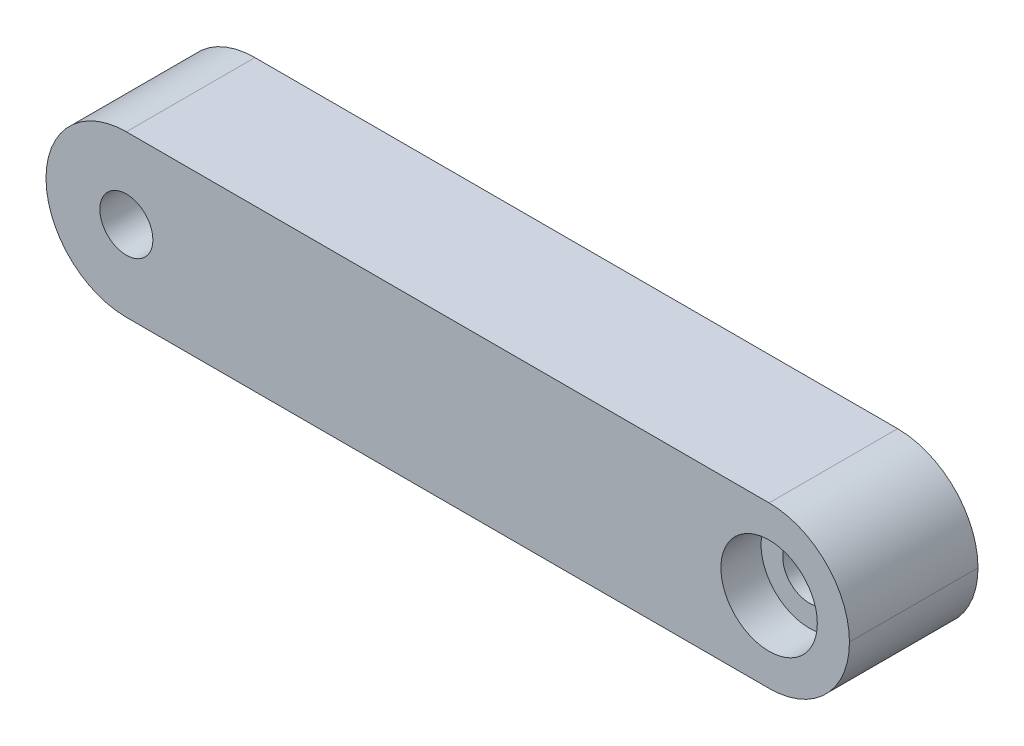
ISO-10303-21;
HEADER;
FILE_DESCRIPTION(('STEP AP214'),'2;1');
FILE_NAME('part.step','',(''),(''),'','','');
FILE_SCHEMA(('AUTOMOTIVE_DESIGN { 1 0 10303 214 1 1 1 1 }'));
ENDSEC;
DATA;
#1=APPLICATION_CONTEXT('core data for automotive mechanical design processes');
#2=APPLICATION_PROTOCOL_DEFINITION('international standard','automotive_design',2000,#1);
#3=PRODUCT_CONTEXT('',#1,'mechanical');
#4=PRODUCT('Part','Part','',(#3));
#5=PRODUCT_RELATED_PRODUCT_CATEGORY('part','',(#4));
#6=PRODUCT_DEFINITION_FORMATION('','',#4);
#7=PRODUCT_DEFINITION_CONTEXT('part definition',#1,'design');
#8=PRODUCT_DEFINITION('design','',#6,#7);
#9=PRODUCT_DEFINITION_SHAPE('','',#8);
#10=(LENGTH_UNIT() NAMED_UNIT(*) SI_UNIT(.MILLI.,.METRE.));
#11=(NAMED_UNIT(*) PLANE_ANGLE_UNIT() SI_UNIT($,.RADIAN.));
#12=(NAMED_UNIT(*) SI_UNIT($,.STERADIAN.) SOLID_ANGLE_UNIT());
#13=UNCERTAINTY_MEASURE_WITH_UNIT(LENGTH_MEASURE(1.E-05),#10,'distance_accuracy_value','');
#14=(GEOMETRIC_REPRESENTATION_CONTEXT(3) GLOBAL_UNCERTAINTY_ASSIGNED_CONTEXT((#13)) GLOBAL_UNIT_ASSIGNED_CONTEXT((#10,
#11,#12)) REPRESENTATION_CONTEXT('',''));
#15=CARTESIAN_POINT('',(0.,0.,0.));
#16=DIRECTION('',(0.,0.,1.));
#17=DIRECTION('',(1.,0.,0.));
#18=AXIS2_PLACEMENT_3D('',#15,#16,#17);
#19=CARTESIAN_POINT('',(5.,5.,0.));
#20=DIRECTION('',(0.,0.,1.));
#21=DIRECTION('',(1.,0.,0.));
#22=AXIS2_PLACEMENT_3D('',#19,#20,#21);
#23=CYLINDRICAL_SURFACE('',#22,1.65);
#24=CARTESIAN_POINT('',(5.,5.,8.));
#25=DIRECTION('',(0.,0.,1.));
#26=DIRECTION('',(1.,0.,0.));
#27=AXIS2_PLACEMENT_3D('',#24,#25,#26);
#28=CIRCLE('',#27,1.65);
#29=CARTESIAN_POINT('',(6.65,5.,8.));
#30=VERTEX_POINT('',#29);
#31=EDGE_CURVE('E191',#30,#30,#28,.T.);
#32=ORIENTED_EDGE('',*,*,#31,.T.);
#33=EDGE_LOOP('',(#32));
#34=FACE_BOUND('',#33,.T.);
#35=CARTESIAN_POINT('',(5.,5.,2.5));
#36=DIRECTION('',(0.,0.,-1.));
#37=DIRECTION('',(-1.,0.,0.));
#38=AXIS2_PLACEMENT_3D('',#35,#36,#37);
#39=CIRCLE('',#38,1.65);
#40=CARTESIAN_POINT('',(3.35,5.,2.5));
#41=VERTEX_POINT('',#40);
#42=EDGE_CURVE('E39',#41,#41,#39,.F.);
#43=ORIENTED_EDGE('',*,*,#42,.F.);
#44=EDGE_LOOP('',(#43));
#45=FACE_BOUND('',#44,.T.);
#46=ADVANCED_FACE('F35',(#34,#45),#23,.F.);
#47=CARTESIAN_POINT('',(45.,5.,0.));
#48=DIRECTION('',(0.,0.,1.));
#49=DIRECTION('',(1.,0.,0.));
#50=AXIS2_PLACEMENT_3D('',#47,#48,#49);
#51=CYLINDRICAL_SURFACE('',#50,1.65);
#52=CARTESIAN_POINT('',(45.,5.,0.));
#53=DIRECTION('',(0.,0.,1.));
#54=DIRECTION('',(1.,0.,0.));
#55=AXIS2_PLACEMENT_3D('',#52,#53,#54);
#56=CIRCLE('',#55,1.65);
#57=CARTESIAN_POINT('',(46.65,5.,0.));
#58=VERTEX_POINT('',#57);
#59=EDGE_CURVE('E188',#58,#58,#56,.T.);
#60=ORIENTED_EDGE('',*,*,#59,.F.);
#61=EDGE_LOOP('',(#60));
#62=FACE_BOUND('',#61,.T.);
#63=CARTESIAN_POINT('',(45.,5.,5.5));
#64=DIRECTION('',(0.,0.,1.));
#65=DIRECTION('',(1.,0.,0.));
#66=AXIS2_PLACEMENT_3D('',#63,#64,#65);
#67=CIRCLE('',#66,1.65);
#68=CARTESIAN_POINT('',(46.65,5.,5.5));
#69=VERTEX_POINT('',#68);
#70=EDGE_CURVE('E184',#69,#69,#67,.F.);
#71=ORIENTED_EDGE('',*,*,#70,.F.);
#72=EDGE_LOOP('',(#71));
#73=FACE_BOUND('',#72,.T.);
#74=ADVANCED_FACE('F237',(#62,#73),#51,.F.);
#75=CARTESIAN_POINT('',(0.,0.,8.));
#76=DIRECTION('',(0.,1.,0.));
#77=DIRECTION('',(0.,0.,1.));
#78=AXIS2_PLACEMENT_3D('',#75,#76,#77);
#79=PLANE('',#78);
#80=DIRECTION('',(1.,0.,0.));
#81=VECTOR('',#80,1.);
#82=CARTESIAN_POINT('',(0.,0.,0.));
#83=LINE('',#82,#81);
#84=CARTESIAN_POINT('',(5.,0.,0.));
#85=VERTEX_POINT('',#84);
#86=CARTESIAN_POINT('',(45.,0.,0.));
#87=VERTEX_POINT('',#86);
#88=EDGE_CURVE('E195',#85,#87,#83,.T.);
#89=ORIENTED_EDGE('',*,*,#88,.T.);
#90=DIRECTION('',(0.,0.,-1.));
#91=VECTOR('',#90,1.);
#92=CARTESIAN_POINT('',(45.,0.,8.));
#93=LINE('',#92,#91);
#94=CARTESIAN_POINT('',(45.,0.,8.));
#95=VERTEX_POINT('',#94);
#96=EDGE_CURVE('E216',#87,#95,#93,.F.);
#97=ORIENTED_EDGE('',*,*,#96,.T.);
#98=DIRECTION('',(1.,0.,0.));
#99=VECTOR('',#98,1.);
#100=CARTESIAN_POINT('',(0.,0.,8.));
#101=LINE('',#100,#99);
#102=CARTESIAN_POINT('',(5.,0.,8.));
#103=VERTEX_POINT('',#102);
#104=EDGE_CURVE('E196',#103,#95,#101,.T.);
#105=ORIENTED_EDGE('',*,*,#104,.F.);
#106=DIRECTION('',(0.,0.,-1.));
#107=VECTOR('',#106,1.);
#108=CARTESIAN_POINT('',(5.,0.,8.));
#109=LINE('',#108,#107);
#110=EDGE_CURVE('E213',#103,#85,#109,.T.);
#111=ORIENTED_EDGE('',*,*,#110,.T.);
#112=EDGE_LOOP('',(#89,#97,#105,#111));
#113=FACE_BOUND('',#112,.T.);
#114=ADVANCED_FACE('F239',(#113),#79,.F.);
#115=CARTESIAN_POINT('',(0.,10.,8.));
#116=DIRECTION('',(0.,-1.,0.));
#117=DIRECTION('',(0.,0.,-1.));
#118=AXIS2_PLACEMENT_3D('',#115,#116,#117);
#119=PLANE('',#118);
#120=DIRECTION('',(-1.,0.,0.));
#121=VECTOR('',#120,1.);
#122=CARTESIAN_POINT('',(0.,10.,8.));
#123=LINE('',#122,#121);
#124=CARTESIAN_POINT('',(45.,10.,8.));
#125=VERTEX_POINT('',#124);
#126=CARTESIAN_POINT('',(5.,10.,8.));
#127=VERTEX_POINT('',#126);
#128=EDGE_CURVE('E199',#125,#127,#123,.T.);
#129=ORIENTED_EDGE('',*,*,#128,.F.);
#130=DIRECTION('',(0.,0.,-1.));
#131=VECTOR('',#130,1.);
#132=CARTESIAN_POINT('',(45.,10.,8.));
#133=LINE('',#132,#131);
#134=CARTESIAN_POINT('',(45.,10.,0.));
#135=VERTEX_POINT('',#134);
#136=EDGE_CURVE('E11',#125,#135,#133,.T.);
#137=ORIENTED_EDGE('',*,*,#136,.T.);
#138=DIRECTION('',(-1.,0.,0.));
#139=VECTOR('',#138,1.);
#140=CARTESIAN_POINT('',(0.,10.,0.));
#141=LINE('',#140,#139);
#142=CARTESIAN_POINT('',(5.,10.,0.));
#143=VERTEX_POINT('',#142);
#144=EDGE_CURVE('E200',#135,#143,#141,.T.);
#145=ORIENTED_EDGE('',*,*,#144,.T.);
#146=DIRECTION('',(0.,0.,-1.));
#147=VECTOR('',#146,1.);
#148=CARTESIAN_POINT('',(5.,10.,8.));
#149=LINE('',#148,#147);
#150=EDGE_CURVE('E44',#143,#127,#149,.F.);
#151=ORIENTED_EDGE('',*,*,#150,.T.);
#152=EDGE_LOOP('',(#129,#137,#145,#151));
#153=FACE_BOUND('',#152,.T.);
#154=ADVANCED_FACE('F246',(#153),#119,.F.);
#155=CARTESIAN_POINT('',(0.,0.,8.));
#156=DIRECTION('',(0.,0.,-1.));
#157=DIRECTION('',(-1.,0.,0.));
#158=AXIS2_PLACEMENT_3D('',#155,#156,#157);
#159=PLANE('',#158);
#160=CARTESIAN_POINT('',(45.,5.,8.));
#161=DIRECTION('',(0.,0.,1.));
#162=DIRECTION('',(1.,0.,0.));
#163=AXIS2_PLACEMENT_3D('',#160,#161,#162);
#164=CIRCLE('',#163,3.);
#165=CARTESIAN_POINT('',(48.,5.,8.));
#166=VERTEX_POINT('',#165);
#167=EDGE_CURVE('E185',#166,#166,#164,.T.);
#168=ORIENTED_EDGE('',*,*,#167,.F.);
#169=EDGE_LOOP('',(#168));
#170=FACE_BOUND('',#169,.T.);
#171=ORIENTED_EDGE('',*,*,#31,.F.);
#172=EDGE_LOOP('',(#171));
#173=FACE_BOUND('',#172,.T.);
#174=ORIENTED_EDGE('',*,*,#104,.T.);
#175=CARTESIAN_POINT('',(45.,5.,8.));
#176=DIRECTION('',(0.,0.,-1.));
#177=DIRECTION('',(-1.,0.,0.));
#178=AXIS2_PLACEMENT_3D('',#175,#176,#177);
#179=CIRCLE('',#178,5.);
#180=CARTESIAN_POINT('',(50.,5.,8.));
#181=VERTEX_POINT('',#180);
#182=EDGE_CURVE('E225',#95,#181,#179,.F.);
#183=ORIENTED_EDGE('',*,*,#182,.T.);
#184=CARTESIAN_POINT('',(45.,5.,8.));
#185=DIRECTION('',(0.,0.,-1.));
#186=DIRECTION('',(-1.,0.,0.));
#187=AXIS2_PLACEMENT_3D('',#184,#185,#186);
#188=CIRCLE('',#187,5.);
#189=EDGE_CURVE('E223',#181,#125,#188,.F.);
#190=ORIENTED_EDGE('',*,*,#189,.T.);
#191=ORIENTED_EDGE('',*,*,#128,.T.);
#192=CARTESIAN_POINT('',(5.,5.,8.));
#193=DIRECTION('',(0.,0.,-1.));
#194=DIRECTION('',(-1.,0.,0.));
#195=AXIS2_PLACEMENT_3D('',#192,#193,#194);
#196=CIRCLE('',#195,5.);
#197=CARTESIAN_POINT('',(0.,5.,8.));
#198=VERTEX_POINT('',#197);
#199=EDGE_CURVE('E219',#127,#198,#196,.F.);
#200=ORIENTED_EDGE('',*,*,#199,.T.);
#201=CARTESIAN_POINT('',(5.,5.,8.));
#202=DIRECTION('',(0.,0.,-1.));
#203=DIRECTION('',(-1.,0.,0.));
#204=AXIS2_PLACEMENT_3D('',#201,#202,#203);
#205=CIRCLE('',#204,5.);
#206=EDGE_CURVE('E221',#198,#103,#205,.F.);
#207=ORIENTED_EDGE('',*,*,#206,.T.);
#208=EDGE_LOOP('',(#174,#183,#190,#191,#200,#207));
#209=FACE_BOUND('',#208,.T.);
#210=ADVANCED_FACE('F256',(#170,#173,#209),#159,.F.);
#211=CARTESIAN_POINT('',(0.,0.,0.));
#212=DIRECTION('',(0.,0.,-1.));
#213=DIRECTION('',(-1.,0.,0.));
#214=AXIS2_PLACEMENT_3D('',#211,#212,#213);
#215=PLANE('',#214);
#216=DIRECTION('',(1.,0.,0.));
#217=VECTOR('',#216,1.);
#218=CARTESIAN_POINT('',(3.4122867597285,7.75000000000009,0.));
#219=LINE('',#218,#217);
#220=CARTESIAN_POINT('',(3.4122867597285,7.75000000000009,0.));
#221=VERTEX_POINT('',#220);
#222=CARTESIAN_POINT('',(6.58771324027144,7.75000000000005,0.));
#223=VERTEX_POINT('',#222);
#224=EDGE_CURVE('E52',#221,#223,#219,.T.);
#225=ORIENTED_EDGE('',*,*,#224,.F.);
#226=DIRECTION('',(0.50000000000001,0.866025403784433,0.));
#227=VECTOR('',#226,1.);
#228=CARTESIAN_POINT('',(1.824573519457,5.00000000000011,0.));
#229=LINE('',#228,#227);
#230=CARTESIAN_POINT('',(1.824573519457,5.00000000000011,0.));
#231=VERTEX_POINT('',#230);
#232=EDGE_CURVE('E148',#231,#221,#229,.T.);
#233=ORIENTED_EDGE('',*,*,#232,.F.);
#234=DIRECTION('',(-0.499999999999994,0.866025403784442,0.));
#235=VECTOR('',#234,1.);
#236=CARTESIAN_POINT('',(3.4122867597285,2.25000000000002,0.));
#237=LINE('',#236,#235);
#238=CARTESIAN_POINT('',(3.4122867597285,2.25000000000002,0.));
#239=VERTEX_POINT('',#238);
#240=EDGE_CURVE('E151',#239,#231,#237,.T.);
#241=ORIENTED_EDGE('',*,*,#240,.F.);
#242=DIRECTION('',(-1.,0.,0.));
#243=VECTOR('',#242,1.);
#244=CARTESIAN_POINT('',(6.58771324027144,2.24999999999998,0.));
#245=LINE('',#244,#243);
#246=CARTESIAN_POINT('',(6.58771324027144,2.24999999999998,0.));
#247=VERTEX_POINT('',#246);
#248=EDGE_CURVE('E167',#247,#239,#245,.T.);
#249=ORIENTED_EDGE('',*,*,#248,.F.);
#250=DIRECTION('',(-0.50000000000001,-0.866025403784433,0.));
#251=VECTOR('',#250,1.);
#252=CARTESIAN_POINT('',(8.17542648054294,4.99999999999996,0.));
#253=LINE('',#252,#251);
#254=CARTESIAN_POINT('',(8.17542648054294,4.99999999999996,0.));
#255=VERTEX_POINT('',#254);
#256=EDGE_CURVE('E164',#255,#247,#253,.T.);
#257=ORIENTED_EDGE('',*,*,#256,.F.);
#258=DIRECTION('',(0.499999999999995,-0.866025403784442,0.));
#259=VECTOR('',#258,1.);
#260=CARTESIAN_POINT('',(6.58771324027144,7.75000000000005,0.));
#261=LINE('',#260,#259);
#262=EDGE_CURVE('E162',#223,#255,#261,.T.);
#263=ORIENTED_EDGE('',*,*,#262,.F.);
#264=EDGE_LOOP('',(#225,#233,#241,#249,#257,#263));
#265=FACE_BOUND('',#264,.T.);
#266=ORIENTED_EDGE('',*,*,#59,.T.);
#267=EDGE_LOOP('',(#266));
#268=FACE_BOUND('',#267,.T.);
#269=CARTESIAN_POINT('',(45.,5.,0.));
#270=DIRECTION('',(0.,0.,-1.));
#271=DIRECTION('',(-1.,0.,0.));
#272=AXIS2_PLACEMENT_3D('',#269,#270,#271);
#273=CIRCLE('',#272,5.);
#274=CARTESIAN_POINT('',(50.,5.,0.));
#275=VERTEX_POINT('',#274);
#276=EDGE_CURVE('E209',#135,#275,#273,.T.);
#277=ORIENTED_EDGE('',*,*,#276,.T.);
#278=CARTESIAN_POINT('',(45.,5.,0.));
#279=DIRECTION('',(0.,0.,-1.));
#280=DIRECTION('',(-1.,0.,0.));
#281=AXIS2_PLACEMENT_3D('',#278,#279,#280);
#282=CIRCLE('',#281,5.);
#283=EDGE_CURVE('E211',#275,#87,#282,.T.);
#284=ORIENTED_EDGE('',*,*,#283,.T.);
#285=ORIENTED_EDGE('',*,*,#88,.F.);
#286=CARTESIAN_POINT('',(5.,5.,0.));
#287=DIRECTION('',(0.,0.,-1.));
#288=DIRECTION('',(-1.,0.,0.));
#289=AXIS2_PLACEMENT_3D('',#286,#287,#288);
#290=CIRCLE('',#289,5.);
#291=CARTESIAN_POINT('',(0.,5.,0.));
#292=VERTEX_POINT('',#291);
#293=EDGE_CURVE('E207',#85,#292,#290,.T.);
#294=ORIENTED_EDGE('',*,*,#293,.T.);
#295=CARTESIAN_POINT('',(5.,5.,0.));
#296=DIRECTION('',(0.,0.,-1.));
#297=DIRECTION('',(-1.,0.,0.));
#298=AXIS2_PLACEMENT_3D('',#295,#296,#297);
#299=CIRCLE('',#298,5.);
#300=EDGE_CURVE('E202',#292,#143,#299,.T.);
#301=ORIENTED_EDGE('',*,*,#300,.T.);
#302=ORIENTED_EDGE('',*,*,#144,.F.);
#303=EDGE_LOOP('',(#277,#284,#285,#294,#301,#302));
#304=FACE_BOUND('',#303,.T.);
#305=ADVANCED_FACE('F259',(#265,#268,#304),#215,.T.);
#306=CARTESIAN_POINT('',(45.,5.,8.));
#307=DIRECTION('',(0.,0.,-1.));
#308=DIRECTION('',(-1.,0.,0.));
#309=AXIS2_PLACEMENT_3D('',#306,#307,#308);
#310=CYLINDRICAL_SURFACE('',#309,5.);
#311=ORIENTED_EDGE('',*,*,#136,.F.);
#312=ORIENTED_EDGE('',*,*,#189,.F.);
#313=DIRECTION('',(0.,0.,-1.));
#314=VECTOR('',#313,1.);
#315=CARTESIAN_POINT('',(50.,5.,8.));
#316=LINE('',#315,#314);
#317=EDGE_CURVE('E192',#275,#181,#316,.F.);
#318=ORIENTED_EDGE('',*,*,#317,.F.);
#319=ORIENTED_EDGE('',*,*,#276,.F.);
#320=EDGE_LOOP('',(#311,#312,#318,#319));
#321=FACE_BOUND('',#320,.T.);
#322=ADVANCED_FACE('F263',(#321),#310,.T.);
#323=CARTESIAN_POINT('',(45.,5.,8.));
#324=DIRECTION('',(0.,0.,-1.));
#325=DIRECTION('',(-1.,0.,0.));
#326=AXIS2_PLACEMENT_3D('',#323,#324,#325);
#327=CYLINDRICAL_SURFACE('',#326,5.);
#328=ORIENTED_EDGE('',*,*,#182,.F.);
#329=ORIENTED_EDGE('',*,*,#96,.F.);
#330=ORIENTED_EDGE('',*,*,#283,.F.);
#331=ORIENTED_EDGE('',*,*,#317,.T.);
#332=EDGE_LOOP('',(#328,#329,#330,#331));
#333=FACE_BOUND('',#332,.T.);
#334=ADVANCED_FACE('F267',(#333),#327,.T.);
#335=CARTESIAN_POINT('',(5.,5.,8.));
#336=DIRECTION('',(0.,0.,-1.));
#337=DIRECTION('',(-1.,0.,0.));
#338=AXIS2_PLACEMENT_3D('',#335,#336,#337);
#339=CYLINDRICAL_SURFACE('',#338,5.);
#340=DIRECTION('',(0.,0.,-1.));
#341=VECTOR('',#340,1.);
#342=CARTESIAN_POINT('',(0.,5.,8.));
#343=LINE('',#342,#341);
#344=EDGE_CURVE('E230',#198,#292,#343,.T.);
#345=ORIENTED_EDGE('',*,*,#344,.F.);
#346=ORIENTED_EDGE('',*,*,#199,.F.);
#347=ORIENTED_EDGE('',*,*,#150,.F.);
#348=ORIENTED_EDGE('',*,*,#300,.F.);
#349=EDGE_LOOP('',(#345,#346,#347,#348));
#350=FACE_BOUND('',#349,.T.);
#351=ADVANCED_FACE('F37',(#350),#339,.T.);
#352=CARTESIAN_POINT('',(5.,5.,8.));
#353=DIRECTION('',(0.,0.,-1.));
#354=DIRECTION('',(-1.,0.,0.));
#355=AXIS2_PLACEMENT_3D('',#352,#353,#354);
#356=CYLINDRICAL_SURFACE('',#355,5.);
#357=ORIENTED_EDGE('',*,*,#206,.F.);
#358=ORIENTED_EDGE('',*,*,#344,.T.);
#359=ORIENTED_EDGE('',*,*,#293,.F.);
#360=ORIENTED_EDGE('',*,*,#110,.F.);
#361=EDGE_LOOP('',(#357,#358,#359,#360));
#362=FACE_BOUND('',#361,.T.);
#363=ADVANCED_FACE('F273',(#362),#356,.T.);
#364=CARTESIAN_POINT('',(45.,5.,5.5));
#365=DIRECTION('',(0.,0.,1.));
#366=DIRECTION('',(1.,0.,0.));
#367=AXIS2_PLACEMENT_3D('',#364,#365,#366);
#368=PLANE('',#367);
#369=CARTESIAN_POINT('',(45.,5.,5.5));
#370=DIRECTION('',(0.,0.,1.));
#371=DIRECTION('',(1.,0.,0.));
#372=AXIS2_PLACEMENT_3D('',#369,#370,#371);
#373=CIRCLE('',#372,3.);
#374=CARTESIAN_POINT('',(48.,5.,5.5));
#375=VERTEX_POINT('',#374);
#376=EDGE_CURVE('E181',#375,#375,#373,.T.);
#377=ORIENTED_EDGE('',*,*,#376,.T.);
#378=EDGE_LOOP('',(#377));
#379=FACE_BOUND('',#378,.T.);
#380=ORIENTED_EDGE('',*,*,#70,.T.);
#381=EDGE_LOOP('',(#380));
#382=FACE_BOUND('',#381,.T.);
#383=ADVANCED_FACE('F235',(#379,#382),#368,.T.);
#384=CARTESIAN_POINT('',(45.,5.,5.5));
#385=DIRECTION('',(0.,0.,1.));
#386=DIRECTION('',(1.,0.,0.));
#387=AXIS2_PLACEMENT_3D('',#384,#385,#386);
#388=CYLINDRICAL_SURFACE('',#387,3.);
#389=ORIENTED_EDGE('',*,*,#376,.F.);
#390=EDGE_LOOP('',(#389));
#391=FACE_BOUND('',#390,.T.);
#392=ORIENTED_EDGE('',*,*,#167,.T.);
#393=EDGE_LOOP('',(#392));
#394=FACE_BOUND('',#393,.T.);
#395=ADVANCED_FACE('F253',(#391,#394),#388,.F.);
#396=CARTESIAN_POINT('',(0.,0.,2.5));
#397=DIRECTION('',(0.,0.,-1.));
#398=DIRECTION('',(-1.,0.,0.));
#399=AXIS2_PLACEMENT_3D('',#396,#397,#398);
#400=PLANE('',#399);
#401=DIRECTION('',(1.,0.,0.));
#402=VECTOR('',#401,1.);
#403=CARTESIAN_POINT('',(3.4122867597285,7.75000000000009,2.5));
#404=LINE('',#403,#402);
#405=CARTESIAN_POINT('',(3.4122867597285,7.75000000000009,2.5));
#406=VERTEX_POINT('',#405);
#407=CARTESIAN_POINT('',(6.58771324027144,7.75000000000005,2.5));
#408=VERTEX_POINT('',#407);
#409=EDGE_CURVE('E128',#406,#408,#404,.T.);
#410=ORIENTED_EDGE('',*,*,#409,.T.);
#411=DIRECTION('',(0.499999999999995,-0.866025403784442,0.));
#412=VECTOR('',#411,1.);
#413=CARTESIAN_POINT('',(6.58771324027144,7.75000000000005,2.5));
#414=LINE('',#413,#412);
#415=CARTESIAN_POINT('',(8.17542648054294,4.99999999999996,2.5));
#416=VERTEX_POINT('',#415);
#417=EDGE_CURVE('E137',#408,#416,#414,.T.);
#418=ORIENTED_EDGE('',*,*,#417,.T.);
#419=DIRECTION('',(-0.50000000000001,-0.866025403784433,0.));
#420=VECTOR('',#419,1.);
#421=CARTESIAN_POINT('',(8.17542648054294,4.99999999999996,2.5));
#422=LINE('',#421,#420);
#423=CARTESIAN_POINT('',(6.58771324027144,2.24999999999998,2.5));
#424=VERTEX_POINT('',#423);
#425=EDGE_CURVE('E142',#416,#424,#422,.T.);
#426=ORIENTED_EDGE('',*,*,#425,.T.);
#427=DIRECTION('',(-1.,0.,0.));
#428=VECTOR('',#427,1.);
#429=CARTESIAN_POINT('',(6.58771324027144,2.24999999999998,2.5));
#430=LINE('',#429,#428);
#431=CARTESIAN_POINT('',(3.4122867597285,2.25000000000002,2.5));
#432=VERTEX_POINT('',#431);
#433=EDGE_CURVE('E155',#424,#432,#430,.T.);
#434=ORIENTED_EDGE('',*,*,#433,.T.);
#435=DIRECTION('',(-0.499999999999994,0.866025403784442,0.));
#436=VECTOR('',#435,1.);
#437=CARTESIAN_POINT('',(3.4122867597285,2.25000000000002,2.5));
#438=LINE('',#437,#436);
#439=CARTESIAN_POINT('',(1.824573519457,5.00000000000011,2.5));
#440=VERTEX_POINT('',#439);
#441=EDGE_CURVE('E158',#432,#440,#438,.T.);
#442=ORIENTED_EDGE('',*,*,#441,.T.);
#443=DIRECTION('',(0.50000000000001,0.866025403784433,0.));
#444=VECTOR('',#443,1.);
#445=CARTESIAN_POINT('',(1.824573519457,5.00000000000011,2.5));
#446=LINE('',#445,#444);
#447=EDGE_CURVE('E134',#440,#406,#446,.T.);
#448=ORIENTED_EDGE('',*,*,#447,.T.);
#449=EDGE_LOOP('',(#410,#418,#426,#434,#442,#448));
#450=FACE_BOUND('',#449,.T.);
#451=ORIENTED_EDGE('',*,*,#42,.T.);
#452=EDGE_LOOP('',(#451));
#453=FACE_BOUND('',#452,.T.);
#454=ADVANCED_FACE('F144',(#450,#453),#400,.T.);
#455=CARTESIAN_POINT('',(3.4122867597285,7.75000000000009,2.5));
#456=DIRECTION('',(0.,1.,0.));
#457=DIRECTION('',(-1.,0.,0.));
#458=AXIS2_PLACEMENT_3D('',#455,#456,#457);
#459=PLANE('',#458);
#460=ORIENTED_EDGE('',*,*,#224,.T.);
#461=DIRECTION('',(0.,0.,-1.));
#462=VECTOR('',#461,1.);
#463=CARTESIAN_POINT('',(6.58771324027144,7.75000000000005,2.5));
#464=LINE('',#463,#462);
#465=EDGE_CURVE('E124',#408,#223,#464,.T.);
#466=ORIENTED_EDGE('',*,*,#465,.F.);
#467=ORIENTED_EDGE('',*,*,#409,.F.);
#468=DIRECTION('',(0.,0.,-1.));
#469=VECTOR('',#468,1.);
#470=CARTESIAN_POINT('',(3.4122867597285,7.75000000000009,2.5));
#471=LINE('',#470,#469);
#472=EDGE_CURVE('E172',#406,#221,#471,.T.);
#473=ORIENTED_EDGE('',*,*,#472,.T.);
#474=EDGE_LOOP('',(#460,#466,#467,#473));
#475=FACE_BOUND('',#474,.T.);
#476=ADVANCED_FACE('F126',(#475),#459,.F.);
#477=CARTESIAN_POINT('',(1.824573519457,5.00000000000011,2.5));
#478=DIRECTION('',(-0.866025403784433,0.50000000000001,0.));
#479=DIRECTION('',(-0.50000000000001,-0.866025403784433,0.));
#480=AXIS2_PLACEMENT_3D('',#477,#478,#479);
#481=PLANE('',#480);
#482=ORIENTED_EDGE('',*,*,#232,.T.);
#483=ORIENTED_EDGE('',*,*,#472,.F.);
#484=ORIENTED_EDGE('',*,*,#447,.F.);
#485=DIRECTION('',(0.,0.,-1.));
#486=VECTOR('',#485,1.);
#487=CARTESIAN_POINT('',(1.824573519457,5.00000000000011,2.5));
#488=LINE('',#487,#486);
#489=EDGE_CURVE('E174',#440,#231,#488,.T.);
#490=ORIENTED_EDGE('',*,*,#489,.T.);
#491=EDGE_LOOP('',(#482,#483,#484,#490));
#492=FACE_BOUND('',#491,.T.);
#493=ADVANCED_FACE('F378',(#492),#481,.F.);
#494=CARTESIAN_POINT('',(3.4122867597285,2.25000000000002,2.5));
#495=DIRECTION('',(-0.866025403784442,-0.499999999999994,0.));
#496=DIRECTION('',(0.499999999999994,-0.866025403784442,0.));
#497=AXIS2_PLACEMENT_3D('',#494,#495,#496);
#498=PLANE('',#497);
#499=ORIENTED_EDGE('',*,*,#240,.T.);
#500=ORIENTED_EDGE('',*,*,#489,.F.);
#501=ORIENTED_EDGE('',*,*,#441,.F.);
#502=DIRECTION('',(0.,0.,-1.));
#503=VECTOR('',#502,1.);
#504=CARTESIAN_POINT('',(3.4122867597285,2.25000000000002,2.5));
#505=LINE('',#504,#503);
#506=EDGE_CURVE('E176',#432,#239,#505,.T.);
#507=ORIENTED_EDGE('',*,*,#506,.T.);
#508=EDGE_LOOP('',(#499,#500,#501,#507));
#509=FACE_BOUND('',#508,.T.);
#510=ADVANCED_FACE('F386',(#509),#498,.F.);
#511=CARTESIAN_POINT('',(6.58771324027144,2.24999999999998,2.5));
#512=DIRECTION('',(0.,-1.,0.));
#513=DIRECTION('',(1.,0.,0.));
#514=AXIS2_PLACEMENT_3D('',#511,#512,#513);
#515=PLANE('',#514);
#516=ORIENTED_EDGE('',*,*,#248,.T.);
#517=ORIENTED_EDGE('',*,*,#506,.F.);
#518=ORIENTED_EDGE('',*,*,#433,.F.);
#519=DIRECTION('',(0.,0.,-1.));
#520=VECTOR('',#519,1.);
#521=CARTESIAN_POINT('',(6.58771324027144,2.24999999999998,2.5));
#522=LINE('',#521,#520);
#523=EDGE_CURVE('E178',#424,#247,#522,.T.);
#524=ORIENTED_EDGE('',*,*,#523,.T.);
#525=EDGE_LOOP('',(#516,#517,#518,#524));
#526=FACE_BOUND('',#525,.T.);
#527=ADVANCED_FACE('F395',(#526),#515,.F.);
#528=CARTESIAN_POINT('',(8.17542648054294,4.99999999999996,2.5));
#529=DIRECTION('',(0.866025403784433,-0.50000000000001,0.));
#530=DIRECTION('',(0.50000000000001,0.866025403784433,0.));
#531=AXIS2_PLACEMENT_3D('',#528,#529,#530);
#532=PLANE('',#531);
#533=ORIENTED_EDGE('',*,*,#256,.T.);
#534=ORIENTED_EDGE('',*,*,#523,.F.);
#535=ORIENTED_EDGE('',*,*,#425,.F.);
#536=DIRECTION('',(0.,0.,-1.));
#537=VECTOR('',#536,1.);
#538=CARTESIAN_POINT('',(8.17542648054294,4.99999999999996,2.5));
#539=LINE('',#538,#537);
#540=EDGE_CURVE('E133',#416,#255,#539,.T.);
#541=ORIENTED_EDGE('',*,*,#540,.T.);
#542=EDGE_LOOP('',(#533,#534,#535,#541));
#543=FACE_BOUND('',#542,.T.);
#544=ADVANCED_FACE('F404',(#543),#532,.F.);
#545=CARTESIAN_POINT('',(6.58771324027144,7.75000000000005,2.5));
#546=DIRECTION('',(0.866025403784442,0.499999999999994,0.));
#547=DIRECTION('',(-0.499999999999995,0.866025403784442,0.));
#548=AXIS2_PLACEMENT_3D('',#545,#546,#547);
#549=PLANE('',#548);
#550=ORIENTED_EDGE('',*,*,#262,.T.);
#551=ORIENTED_EDGE('',*,*,#540,.F.);
#552=ORIENTED_EDGE('',*,*,#417,.F.);
#553=ORIENTED_EDGE('',*,*,#465,.T.);
#554=EDGE_LOOP('',(#550,#551,#552,#553));
#555=FACE_BOUND('',#554,.T.);
#556=ADVANCED_FACE('F138',(#555),#549,.F.);
#557=CLOSED_SHELL('',(#46,#74,#114,#154,#210,#305,#322,#334,#351,#363,#383,#395,#454,#476,#493,
#510,#527,#544,#556));
#558=MANIFOLD_SOLID_BREP('B2',#557);
#559=ADVANCED_BREP_SHAPE_REPRESENTATION('',(#18,#558),#14);
#560=SHAPE_DEFINITION_REPRESENTATION(#9,#559);
ENDSEC;
END-ISO-10303-21;
